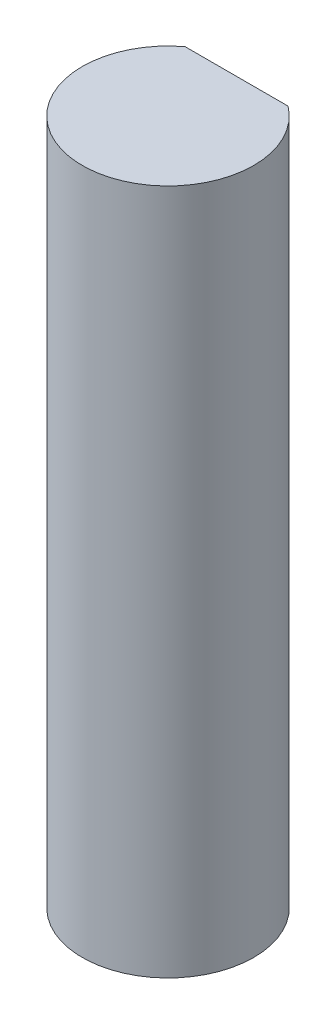
ISO-10303-21;
HEADER;
FILE_DESCRIPTION(('STEP AP214'),'2;1');
FILE_NAME('part.step','',(''),(''),'','','');
FILE_SCHEMA(('AUTOMOTIVE_DESIGN { 1 0 10303 214 1 1 1 1 }'));
ENDSEC;
DATA;
#1=APPLICATION_CONTEXT('core data for automotive mechanical design processes');
#2=APPLICATION_PROTOCOL_DEFINITION('international standard','automotive_design',2000,#1);
#3=PRODUCT_CONTEXT('',#1,'mechanical');
#4=PRODUCT('Part','Part','',(#3));
#5=PRODUCT_RELATED_PRODUCT_CATEGORY('part','',(#4));
#6=PRODUCT_DEFINITION_FORMATION('','',#4);
#7=PRODUCT_DEFINITION_CONTEXT('part definition',#1,'design');
#8=PRODUCT_DEFINITION('design','',#6,#7);
#9=PRODUCT_DEFINITION_SHAPE('','',#8);
#10=(LENGTH_UNIT() NAMED_UNIT(*) SI_UNIT(.MILLI.,.METRE.));
#11=(NAMED_UNIT(*) PLANE_ANGLE_UNIT() SI_UNIT($,.RADIAN.));
#12=(NAMED_UNIT(*) SI_UNIT($,.STERADIAN.) SOLID_ANGLE_UNIT());
#13=UNCERTAINTY_MEASURE_WITH_UNIT(LENGTH_MEASURE(1.E-05),#10,'distance_accuracy_value','');
#14=(GEOMETRIC_REPRESENTATION_CONTEXT(3) GLOBAL_UNCERTAINTY_ASSIGNED_CONTEXT((#13)) GLOBAL_UNIT_ASSIGNED_CONTEXT((#10,
#11,#12)) REPRESENTATION_CONTEXT('',''));
#15=CARTESIAN_POINT('',(0.,0.,0.));
#16=DIRECTION('',(0.,0.,1.));
#17=DIRECTION('',(1.,0.,0.));
#18=AXIS2_PLACEMENT_3D('',#15,#16,#17);
#19=CARTESIAN_POINT('',(0.,25.4,0.));
#20=DIRECTION('',(0.,-1.,0.));
#21=DIRECTION('',(0.,0.,-1.));
#22=AXIS2_PLACEMENT_3D('',#19,#20,#21);
#23=CYLINDRICAL_SURFACE('',#22,3.175);
#24=CARTESIAN_POINT('',(0.,0.,0.));
#25=DIRECTION('',(0.,1.,0.));
#26=DIRECTION('',(0.,0.,1.));
#27=AXIS2_PLACEMENT_3D('',#24,#25,#26);
#28=CIRCLE('',#27,3.175);
#29=CARTESIAN_POINT('',(-1.905,0.,-2.54));
#30=VERTEX_POINT('',#29);
#31=CARTESIAN_POINT('',(1.905,0.,-2.54));
#32=VERTEX_POINT('',#31);
#33=EDGE_CURVE('E64',#30,#32,#28,.T.);
#34=ORIENTED_EDGE('',*,*,#33,.T.);
#35=DIRECTION('',(0.,-1.,0.));
#36=VECTOR('',#35,1.);
#37=CARTESIAN_POINT('',(1.905,25.4,-2.54));
#38=LINE('',#37,#36);
#39=CARTESIAN_POINT('',(1.905,25.4,-2.54));
#40=VERTEX_POINT('',#39);
#41=EDGE_CURVE('E11',#40,#32,#38,.T.);
#42=ORIENTED_EDGE('',*,*,#41,.F.);
#43=CARTESIAN_POINT('',(0.,25.4,0.));
#44=DIRECTION('',(0.,1.,0.));
#45=DIRECTION('',(0.,0.,1.));
#46=AXIS2_PLACEMENT_3D('',#43,#44,#45);
#47=CIRCLE('',#46,3.175);
#48=CARTESIAN_POINT('',(-1.905,25.4,-2.54));
#49=VERTEX_POINT('',#48);
#50=EDGE_CURVE('E63',#49,#40,#47,.T.);
#51=ORIENTED_EDGE('',*,*,#50,.F.);
#52=DIRECTION('',(0.,-1.,0.));
#53=VECTOR('',#52,1.);
#54=CARTESIAN_POINT('',(-1.905,25.4,-2.54));
#55=LINE('',#54,#53);
#56=EDGE_CURVE('E41',#49,#30,#55,.T.);
#57=ORIENTED_EDGE('',*,*,#56,.T.);
#58=EDGE_LOOP('',(#34,#42,#51,#57));
#59=FACE_BOUND('',#58,.T.);
#60=ADVANCED_FACE('F33',(#59),#23,.T.);
#61=CARTESIAN_POINT('',(-1.905,25.4,-2.54));
#62=DIRECTION('',(0.,0.,1.));
#63=DIRECTION('',(1.,0.,0.));
#64=AXIS2_PLACEMENT_3D('',#61,#62,#63);
#65=PLANE('',#64);
#66=DIRECTION('',(-1.,0.,0.));
#67=VECTOR('',#66,1.);
#68=CARTESIAN_POINT('',(-1.905,0.,-2.54));
#69=LINE('',#68,#67);
#70=EDGE_CURVE('E56',#32,#30,#69,.T.);
#71=ORIENTED_EDGE('',*,*,#70,.T.);
#72=ORIENTED_EDGE('',*,*,#56,.F.);
#73=DIRECTION('',(-1.,0.,0.));
#74=VECTOR('',#73,1.);
#75=CARTESIAN_POINT('',(-1.905,25.4,-2.54));
#76=LINE('',#75,#74);
#77=EDGE_CURVE('E48',#40,#49,#76,.T.);
#78=ORIENTED_EDGE('',*,*,#77,.F.);
#79=ORIENTED_EDGE('',*,*,#41,.T.);
#80=EDGE_LOOP('',(#71,#72,#78,#79));
#81=FACE_BOUND('',#80,.T.);
#82=ADVANCED_FACE('F59',(#81),#65,.F.);
#83=CARTESIAN_POINT('',(0.,25.4,0.));
#84=DIRECTION('',(0.,1.,0.));
#85=DIRECTION('',(0.,0.,1.));
#86=AXIS2_PLACEMENT_3D('',#83,#84,#85);
#87=PLANE('',#86);
#88=ORIENTED_EDGE('',*,*,#50,.T.);
#89=ORIENTED_EDGE('',*,*,#77,.T.);
#90=EDGE_LOOP('',(#88,#89));
#91=FACE_BOUND('',#90,.T.);
#92=ADVANCED_FACE('F71',(#91),#87,.T.);
#93=CARTESIAN_POINT('',(0.,0.,0.));
#94=DIRECTION('',(0.,1.,0.));
#95=DIRECTION('',(0.,0.,1.));
#96=AXIS2_PLACEMENT_3D('',#93,#94,#95);
#97=PLANE('',#96);
#98=ORIENTED_EDGE('',*,*,#33,.F.);
#99=ORIENTED_EDGE('',*,*,#70,.F.);
#100=EDGE_LOOP('',(#98,#99));
#101=FACE_BOUND('',#100,.T.);
#102=ADVANCED_FACE('F67',(#101),#97,.F.);
#103=CLOSED_SHELL('',(#60,#82,#92,#102));
#104=MANIFOLD_SOLID_BREP('B2',#103);
#105=ADVANCED_BREP_SHAPE_REPRESENTATION('',(#18,#104),#14);
#106=SHAPE_DEFINITION_REPRESENTATION(#9,#105);
ENDSEC;
END-ISO-10303-21;
